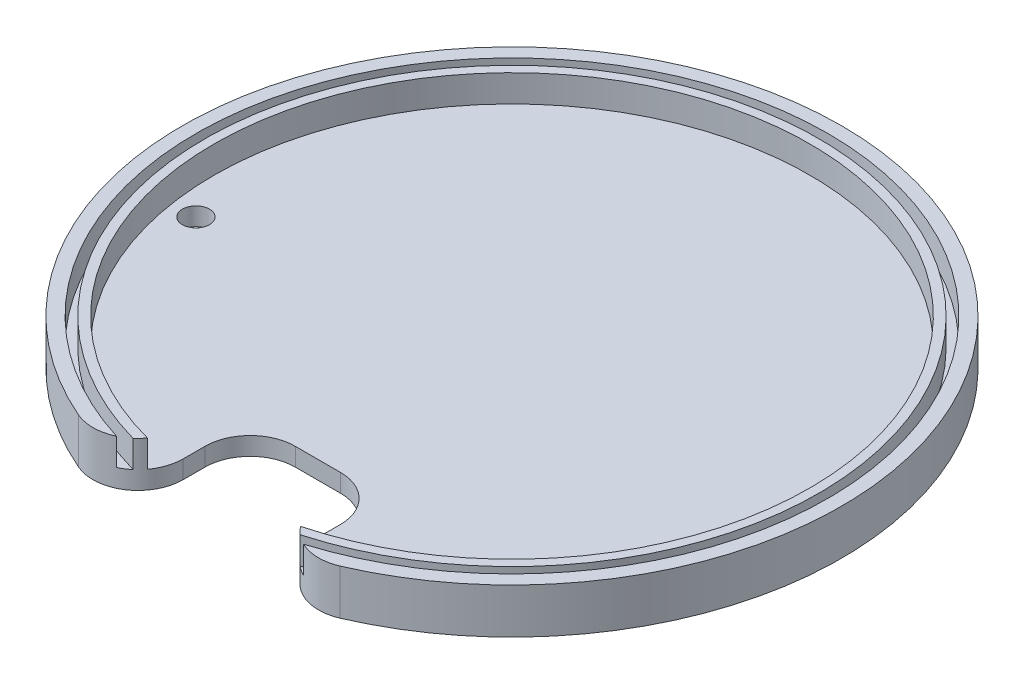
ISO-10303-21;
HEADER;
FILE_DESCRIPTION(('STEP AP214'),'2;1');
FILE_NAME('part.step','',(''),(''),'','','');
FILE_SCHEMA(('AUTOMOTIVE_DESIGN { 1 0 10303 214 1 1 1 1 }'));
ENDSEC;
DATA;
#1=APPLICATION_CONTEXT('core data for automotive mechanical design processes');
#2=APPLICATION_PROTOCOL_DEFINITION('international standard','automotive_design',2000,#1);
#3=PRODUCT_CONTEXT('',#1,'mechanical');
#4=PRODUCT('Part','Part','',(#3));
#5=PRODUCT_RELATED_PRODUCT_CATEGORY('part','',(#4));
#6=PRODUCT_DEFINITION_FORMATION('','',#4);
#7=PRODUCT_DEFINITION_CONTEXT('part definition',#1,'design');
#8=PRODUCT_DEFINITION('design','',#6,#7);
#9=PRODUCT_DEFINITION_SHAPE('','',#8);
#10=(LENGTH_UNIT() NAMED_UNIT(*) SI_UNIT(.MILLI.,.METRE.));
#11=(NAMED_UNIT(*) PLANE_ANGLE_UNIT() SI_UNIT($,.RADIAN.));
#12=(NAMED_UNIT(*) SI_UNIT($,.STERADIAN.) SOLID_ANGLE_UNIT());
#13=UNCERTAINTY_MEASURE_WITH_UNIT(LENGTH_MEASURE(1.E-05),#10,'distance_accuracy_value','');
#14=(GEOMETRIC_REPRESENTATION_CONTEXT(3) GLOBAL_UNCERTAINTY_ASSIGNED_CONTEXT((#13)) GLOBAL_UNIT_ASSIGNED_CONTEXT((#10,
#11,#12)) REPRESENTATION_CONTEXT('',''));
#15=CARTESIAN_POINT('',(0.,0.,0.));
#16=DIRECTION('',(0.,0.,1.));
#17=DIRECTION('',(1.,0.,0.));
#18=AXIS2_PLACEMENT_3D('',#15,#16,#17);
#19=CARTESIAN_POINT('',(0.,4.,0.));
#20=DIRECTION('',(0.,1.,0.));
#21=DIRECTION('',(0.,0.,1.));
#22=AXIS2_PLACEMENT_3D('',#19,#20,#21);
#23=PLANE('',#22);
#24=CARTESIAN_POINT('',(0.,4.,0.));
#25=DIRECTION('',(0.,1.,0.));
#26=DIRECTION('',(0.,0.,1.));
#27=AXIS2_PLACEMENT_3D('',#24,#25,#26);
#28=CIRCLE('',#27,68.);
#29=CARTESIAN_POINT('',(18.5073957889655,4.0000000000007,65.4329909228562));
#30=VERTEX_POINT('',#29);
#31=CARTESIAN_POINT('',(-18.5073957889656,4.0000000000007,65.4329909228562));
#32=VERTEX_POINT('',#31);
#33=EDGE_CURVE('E324',#30,#32,#28,.T.);
#34=ORIENTED_EDGE('',*,*,#33,.F.);
#35=CARTESIAN_POINT('',(25.,4.,57.8273291792038));
#36=DIRECTION('',(0.,1.,0.));
#37=DIRECTION('',(0.,0.,1.));
#38=AXIS2_PLACEMENT_3D('',#35,#36,#37);
#39=CIRCLE('',#38,10.);
#40=CARTESIAN_POINT('',(20.7174977817259,4.0000000000007,66.8639311263119));
#41=VERTEX_POINT('',#40);
#42=EDGE_CURVE('E219',#30,#41,#39,.T.);
#43=ORIENTED_EDGE('',*,*,#42,.T.);
#44=CARTESIAN_POINT('',(0.,4.,0.));
#45=DIRECTION('',(0.,1.,0.));
#46=DIRECTION('',(0.,0.,1.));
#47=AXIS2_PLACEMENT_3D('',#44,#45,#46);
#48=CIRCLE('',#47,70.);
#49=CARTESIAN_POINT('',(-20.717497781726,4.0000000000007,66.8639311263119));
#50=VERTEX_POINT('',#49);
#51=EDGE_CURVE('E185',#50,#41,#48,.F.);
#52=ORIENTED_EDGE('',*,*,#51,.F.);
#53=CARTESIAN_POINT('',(-25.,4.,57.8273291792039));
#54=DIRECTION('',(0.,1.,0.));
#55=DIRECTION('',(0.,0.,1.));
#56=AXIS2_PLACEMENT_3D('',#53,#54,#55);
#57=CIRCLE('',#56,10.);
#58=EDGE_CURVE('E216',#50,#32,#57,.T.);
#59=ORIENTED_EDGE('',*,*,#58,.T.);
#60=EDGE_LOOP('',(#34,#43,#52,#59));
#61=FACE_BOUND('',#60,.T.);
#62=ADVANCED_FACE('F52',(#61),#23,.T.);
#63=CARTESIAN_POINT('',(0.,10.,0.));
#64=DIRECTION('',(0.,-1.,0.));
#65=DIRECTION('',(0.,0.,-1.));
#66=AXIS2_PLACEMENT_3D('',#63,#64,#65);
#67=CYLINDRICAL_SURFACE('',#66,66.);
#68=CARTESIAN_POINT('',(0.,4.,0.));
#69=DIRECTION('',(0.,1.,0.));
#70=DIRECTION('',(0.,0.,1.));
#71=AXIS2_PLACEMENT_3D('',#68,#69,#70);
#72=CIRCLE('',#71,66.);
#73=CARTESIAN_POINT('',(-16.9662244483811,4.0000000000007,63.7820290361412));
#74=VERTEX_POINT('',#73);
#75=CARTESIAN_POINT('',(16.9662244483811,4.0000000000007,63.7820290361412));
#76=VERTEX_POINT('',#75);
#77=EDGE_CURVE('E192',#74,#76,#72,.F.);
#78=ORIENTED_EDGE('',*,*,#77,.T.);
#79=DIRECTION('',(0.,-1.,0.));
#80=VECTOR('',#79,1.);
#81=CARTESIAN_POINT('',(16.9662244483811,4.0000000000007,63.7820290361412));
#82=LINE('',#81,#80);
#83=CARTESIAN_POINT('',(16.9662244483811,10.0000000000007,63.7820290361412));
#84=VERTEX_POINT('',#83);
#85=EDGE_CURVE('E201',#76,#84,#82,.F.);
#86=ORIENTED_EDGE('',*,*,#85,.T.);
#87=CARTESIAN_POINT('',(0.,10.,0.));
#88=DIRECTION('',(0.,1.,0.));
#89=DIRECTION('',(0.,0.,1.));
#90=AXIS2_PLACEMENT_3D('',#87,#88,#89);
#91=CIRCLE('',#90,66.);
#92=CARTESIAN_POINT('',(-16.9662244483811,10.0000000000007,63.7820290361407));
#93=VERTEX_POINT('',#92);
#94=EDGE_CURVE('E325',#84,#93,#91,.T.);
#95=ORIENTED_EDGE('',*,*,#94,.T.);
#96=DIRECTION('',(0.,-1.,0.));
#97=VECTOR('',#96,1.);
#98=CARTESIAN_POINT('',(-16.9662244483811,10.0000000000007,63.7820290361407));
#99=LINE('',#98,#97);
#100=EDGE_CURVE('E198',#93,#74,#99,.T.);
#101=ORIENTED_EDGE('',*,*,#100,.T.);
#102=EDGE_LOOP('',(#78,#86,#95,#101));
#103=FACE_BOUND('',#102,.T.);
#104=ADVANCED_FACE('F342',(#103),#67,.F.);
#105=CARTESIAN_POINT('',(0.,10.,0.));
#106=DIRECTION('',(0.,-1.,0.));
#107=DIRECTION('',(0.,0.,-1.));
#108=AXIS2_PLACEMENT_3D('',#105,#106,#107);
#109=CYLINDRICAL_SURFACE('',#108,68.);
#110=CARTESIAN_POINT('',(0.,10.,0.));
#111=DIRECTION('',(0.,1.,0.));
#112=DIRECTION('',(0.,0.,1.));
#113=AXIS2_PLACEMENT_3D('',#110,#111,#112);
#114=CIRCLE('',#113,68.);
#115=CARTESIAN_POINT('',(18.5073957889655,10.0000000000007,65.4329909228562));
#116=VERTEX_POINT('',#115);
#117=CARTESIAN_POINT('',(-18.5073957889656,10.0000000000007,65.4329909228562));
#118=VERTEX_POINT('',#117);
#119=EDGE_CURVE('E329',#116,#118,#114,.T.);
#120=ORIENTED_EDGE('',*,*,#119,.F.);
#121=DIRECTION('',(0.,-1.,0.));
#122=VECTOR('',#121,1.);
#123=CARTESIAN_POINT('',(18.5073957889655,10.0000000000007,65.4329909228562));
#124=LINE('',#123,#122);
#125=EDGE_CURVE('E213',#116,#30,#124,.T.);
#126=ORIENTED_EDGE('',*,*,#125,.T.);
#127=ORIENTED_EDGE('',*,*,#33,.T.);
#128=DIRECTION('',(0.,-1.,0.));
#129=VECTOR('',#128,1.);
#130=CARTESIAN_POINT('',(-18.5073957889656,4.0000000000007,65.4329909228562));
#131=LINE('',#130,#129);
#132=EDGE_CURVE('E210',#32,#118,#131,.F.);
#133=ORIENTED_EDGE('',*,*,#132,.T.);
#134=EDGE_LOOP('',(#120,#126,#127,#133));
#135=FACE_BOUND('',#134,.T.);
#136=ADVANCED_FACE('F354',(#135),#109,.T.);
#137=CARTESIAN_POINT('',(0.,10.,0.));
#138=DIRECTION('',(0.,1.,0.));
#139=DIRECTION('',(0.,0.,1.));
#140=AXIS2_PLACEMENT_3D('',#137,#138,#139);
#141=PLANE('',#140);
#142=ORIENTED_EDGE('',*,*,#94,.F.);
#143=CARTESIAN_POINT('',(25.,9.99999999999998,57.8273291792038));
#144=DIRECTION('',(0.,1.,0.));
#145=DIRECTION('',(0.,0.,1.));
#146=AXIS2_PLACEMENT_3D('',#143,#144,#145);
#147=CIRCLE('',#146,10.);
#148=EDGE_CURVE('E207',#84,#116,#147,.T.);
#149=ORIENTED_EDGE('',*,*,#148,.T.);
#150=ORIENTED_EDGE('',*,*,#119,.T.);
#151=CARTESIAN_POINT('',(-25.,9.99999999999998,57.8273291792036));
#152=DIRECTION('',(0.,1.,0.));
#153=DIRECTION('',(0.,0.,1.));
#154=AXIS2_PLACEMENT_3D('',#151,#152,#153);
#155=CIRCLE('',#154,10.);
#156=EDGE_CURVE('E204',#118,#93,#155,.T.);
#157=ORIENTED_EDGE('',*,*,#156,.T.);
#158=EDGE_LOOP('',(#142,#149,#150,#157));
#159=FACE_BOUND('',#158,.T.);
#160=ADVANCED_FACE('F351',(#159),#141,.T.);
#161=CARTESIAN_POINT('',(-60.,4.,10.0000000000001));
#162=DIRECTION('',(0.,1.,0.));
#163=DIRECTION('',(0.,0.,1.));
#164=AXIS2_PLACEMENT_3D('',#161,#162,#163);
#165=CIRCLE('',#164,3.);
#166=CARTESIAN_POINT('',(-60.,4.,13.0000000000001));
#167=VERTEX_POINT('',#166);
#168=EDGE_CURVE('E368',#167,#167,#165,.F.);
#169=ORIENTED_EDGE('',*,*,#168,.T.);
#170=EDGE_LOOP('',(#169));
#171=FACE_BOUND('',#170,.T.);
#172=DIRECTION('',(1.,0.,0.));
#173=VECTOR('',#172,1.);
#174=CARTESIAN_POINT('',(-15.,4.,43.));
#175=LINE('',#174,#173);
#176=CARTESIAN_POINT('',(-5.,4.,43.));
#177=VERTEX_POINT('',#176);
#178=CARTESIAN_POINT('',(4.99999999999998,4.,43.0000000000002));
#179=VERTEX_POINT('',#178);
#180=EDGE_CURVE('E164',#177,#179,#175,.T.);
#181=ORIENTED_EDGE('',*,*,#180,.T.);
#182=CARTESIAN_POINT('',(4.99999999999995,4.,53.0000000000002));
#183=DIRECTION('',(0.,1.,0.));
#184=DIRECTION('',(0.,0.,1.));
#185=AXIS2_PLACEMENT_3D('',#182,#183,#184);
#186=CIRCLE('',#185,10.);
#187=CARTESIAN_POINT('',(15.,4.,53.));
#188=VERTEX_POINT('',#187);
#189=EDGE_CURVE('E259',#179,#188,#186,.F.);
#190=ORIENTED_EDGE('',*,*,#189,.T.);
#191=DIRECTION('',(0.,0.,1.));
#192=VECTOR('',#191,1.);
#193=CARTESIAN_POINT('',(14.9999999999999,4.00000000000067,73.));
#194=LINE('',#193,#192);
#195=CARTESIAN_POINT('',(15.,4.,57.8273291792038));
#196=VERTEX_POINT('',#195);
#197=EDGE_CURVE('E293',#188,#196,#194,.T.);
#198=ORIENTED_EDGE('',*,*,#197,.T.);
#199=CARTESIAN_POINT('',(25.,4.,57.8273291792038));
#200=DIRECTION('',(0.,1.,0.));
#201=DIRECTION('',(0.,0.,1.));
#202=AXIS2_PLACEMENT_3D('',#199,#200,#201);
#203=CIRCLE('',#202,10.);
#204=EDGE_CURVE('E182',#196,#76,#203,.T.);
#205=ORIENTED_EDGE('',*,*,#204,.T.);
#206=ORIENTED_EDGE('',*,*,#77,.F.);
#207=CARTESIAN_POINT('',(-25.,4.,57.8273291792039));
#208=DIRECTION('',(0.,1.,0.));
#209=DIRECTION('',(0.,0.,1.));
#210=AXIS2_PLACEMENT_3D('',#207,#208,#209);
#211=CIRCLE('',#210,10.);
#212=CARTESIAN_POINT('',(-15.0000000000001,4.,57.8273291792039));
#213=VERTEX_POINT('',#212);
#214=EDGE_CURVE('E184',#74,#213,#211,.T.);
#215=ORIENTED_EDGE('',*,*,#214,.T.);
#216=DIRECTION('',(0.,0.,-1.));
#217=VECTOR('',#216,1.);
#218=CARTESIAN_POINT('',(-15.0000000000001,4.0000000000007,73.));
#219=LINE('',#218,#217);
#220=CARTESIAN_POINT('',(-15.,4.,53.));
#221=VERTEX_POINT('',#220);
#222=EDGE_CURVE('E298',#213,#221,#219,.T.);
#223=ORIENTED_EDGE('',*,*,#222,.T.);
#224=CARTESIAN_POINT('',(-5.,4.,53.));
#225=DIRECTION('',(0.,1.,0.));
#226=DIRECTION('',(0.,0.,1.));
#227=AXIS2_PLACEMENT_3D('',#224,#225,#226);
#228=CIRCLE('',#227,10.);
#229=EDGE_CURVE('E12',#221,#177,#228,.F.);
#230=ORIENTED_EDGE('',*,*,#229,.T.);
#231=EDGE_LOOP('',(#181,#190,#198,#205,#206,#215,#223,#230));
#232=FACE_BOUND('',#231,.T.);
#233=ADVANCED_FACE('F292',(#171,#232),#23,.T.);
#234=CARTESIAN_POINT('',(0.,10.,0.));
#235=DIRECTION('',(0.,-1.,0.));
#236=DIRECTION('',(0.,0.,-1.));
#237=AXIS2_PLACEMENT_3D('',#234,#235,#236);
#238=CYLINDRICAL_SURFACE('',#237,70.);
#239=ORIENTED_EDGE('',*,*,#51,.T.);
#240=DIRECTION('',(0.,-1.,0.));
#241=VECTOR('',#240,1.);
#242=CARTESIAN_POINT('',(20.7174977817259,4.0000000000007,66.8639311263119));
#243=LINE('',#242,#241);
#244=CARTESIAN_POINT('',(20.7174977817259,10.0000000000007,66.8639311263119));
#245=VERTEX_POINT('',#244);
#246=EDGE_CURVE('E225',#41,#245,#243,.F.);
#247=ORIENTED_EDGE('',*,*,#246,.T.);
#248=CARTESIAN_POINT('',(0.,10.,0.));
#249=DIRECTION('',(0.,1.,0.));
#250=DIRECTION('',(0.,0.,1.));
#251=AXIS2_PLACEMENT_3D('',#248,#249,#250);
#252=CIRCLE('',#251,70.);
#253=CARTESIAN_POINT('',(-20.717497781726,10.0000000000007,66.8639311263115));
#254=VERTEX_POINT('',#253);
#255=EDGE_CURVE('E316',#245,#254,#252,.T.);
#256=ORIENTED_EDGE('',*,*,#255,.T.);
#257=DIRECTION('',(0.,-1.,0.));
#258=VECTOR('',#257,1.);
#259=CARTESIAN_POINT('',(-20.717497781726,10.0000000000007,66.8639311263115));
#260=LINE('',#259,#258);
#261=EDGE_CURVE('E222',#254,#50,#260,.T.);
#262=ORIENTED_EDGE('',*,*,#261,.T.);
#263=EDGE_LOOP('',(#239,#247,#256,#262));
#264=FACE_BOUND('',#263,.T.);
#265=ADVANCED_FACE('F389',(#264),#238,.F.);
#266=CARTESIAN_POINT('',(0.,10.,0.));
#267=DIRECTION('',(0.,1.,0.));
#268=DIRECTION('',(0.,0.,1.));
#269=AXIS2_PLACEMENT_3D('',#266,#267,#268);
#270=PLANE('',#269);
#271=ORIENTED_EDGE('',*,*,#255,.F.);
#272=CARTESIAN_POINT('',(25.,9.99999999999998,57.8273291792038));
#273=DIRECTION('',(0.,1.,0.));
#274=DIRECTION('',(0.,0.,1.));
#275=AXIS2_PLACEMENT_3D('',#272,#273,#274);
#276=CIRCLE('',#275,10.);
#277=CARTESIAN_POINT('',(28.9682539682539,10.0000000000007,67.00627031876));
#278=VERTEX_POINT('',#277);
#279=EDGE_CURVE('E231',#245,#278,#276,.T.);
#280=ORIENTED_EDGE('',*,*,#279,.T.);
#281=CARTESIAN_POINT('',(0.,10.,0.));
#282=DIRECTION('',(0.,1.,0.));
#283=DIRECTION('',(0.,0.,1.));
#284=AXIS2_PLACEMENT_3D('',#281,#282,#283);
#285=CIRCLE('',#284,73.);
#286=CARTESIAN_POINT('',(-28.968253968254,10.0000000000007,67.00627031876));
#287=VERTEX_POINT('',#286);
#288=EDGE_CURVE('E320',#278,#287,#285,.T.);
#289=ORIENTED_EDGE('',*,*,#288,.T.);
#290=CARTESIAN_POINT('',(-25.,9.99999999999998,57.8273291792036));
#291=DIRECTION('',(0.,1.,0.));
#292=DIRECTION('',(0.,0.,1.));
#293=AXIS2_PLACEMENT_3D('',#290,#291,#292);
#294=CIRCLE('',#293,10.);
#295=EDGE_CURVE('E228',#287,#254,#294,.T.);
#296=ORIENTED_EDGE('',*,*,#295,.T.);
#297=EDGE_LOOP('',(#271,#280,#289,#296));
#298=FACE_BOUND('',#297,.T.);
#299=ADVANCED_FACE('F381',(#298),#270,.T.);
#300=CARTESIAN_POINT('',(0.,0.,0.));
#301=DIRECTION('',(0.,1.,0.));
#302=DIRECTION('',(0.,0.,1.));
#303=AXIS2_PLACEMENT_3D('',#300,#301,#302);
#304=PLANE('',#303);
#305=CARTESIAN_POINT('',(-60.,0.,10.0000000000001));
#306=DIRECTION('',(0.,-1.,0.));
#307=DIRECTION('',(0.,0.,-1.));
#308=AXIS2_PLACEMENT_3D('',#305,#306,#307);
#309=CIRCLE('',#308,3.);
#310=CARTESIAN_POINT('',(-60.,0.,7.00000000000011));
#311=VERTEX_POINT('',#310);
#312=EDGE_CURVE('E299',#311,#311,#309,.T.);
#313=ORIENTED_EDGE('',*,*,#312,.F.);
#314=EDGE_LOOP('',(#313));
#315=FACE_BOUND('',#314,.T.);
#316=CARTESIAN_POINT('',(0.,0.,0.));
#317=DIRECTION('',(0.,1.,0.));
#318=DIRECTION('',(0.,0.,1.));
#319=AXIS2_PLACEMENT_3D('',#316,#317,#318);
#320=CIRCLE('',#319,73.);
#321=CARTESIAN_POINT('',(28.9682539682539,6.93889390390723E-13,67.00627031876));
#322=VERTEX_POINT('',#321);
#323=CARTESIAN_POINT('',(-28.968253968254,6.93889390390723E-13,67.00627031876));
#324=VERTEX_POINT('',#323);
#325=EDGE_CURVE('E172',#322,#324,#320,.T.);
#326=ORIENTED_EDGE('',*,*,#325,.F.);
#327=CARTESIAN_POINT('',(25.,0.,57.8273291792038));
#328=DIRECTION('',(0.,1.,0.));
#329=DIRECTION('',(0.,0.,1.));
#330=AXIS2_PLACEMENT_3D('',#327,#328,#329);
#331=CIRCLE('',#330,10.);
#332=CARTESIAN_POINT('',(15.,0.,57.8273291792038));
#333=VERTEX_POINT('',#332);
#334=EDGE_CURVE('E169',#322,#333,#331,.F.);
#335=ORIENTED_EDGE('',*,*,#334,.T.);
#336=DIRECTION('',(0.,0.,1.));
#337=VECTOR('',#336,1.);
#338=CARTESIAN_POINT('',(14.9999999999999,6.93889390390723E-13,73.));
#339=LINE('',#338,#337);
#340=CARTESIAN_POINT('',(15.,0.,53.));
#341=VERTEX_POINT('',#340);
#342=EDGE_CURVE('E155',#341,#333,#339,.T.);
#343=ORIENTED_EDGE('',*,*,#342,.F.);
#344=CARTESIAN_POINT('',(4.99999999999996,0.,53.));
#345=DIRECTION('',(0.,1.,0.));
#346=DIRECTION('',(0.,0.,1.));
#347=AXIS2_PLACEMENT_3D('',#344,#345,#346);
#348=CIRCLE('',#347,10.);
#349=CARTESIAN_POINT('',(4.99999999999998,0.,43.));
#350=VERTEX_POINT('',#349);
#351=EDGE_CURVE('E256',#341,#350,#348,.T.);
#352=ORIENTED_EDGE('',*,*,#351,.T.);
#353=DIRECTION('',(1.,0.,0.));
#354=VECTOR('',#353,1.);
#355=CARTESIAN_POINT('',(-15.,0.,43.));
#356=LINE('',#355,#354);
#357=CARTESIAN_POINT('',(-5.,0.,43.0000000000002));
#358=VERTEX_POINT('',#357);
#359=EDGE_CURVE('E165',#358,#350,#356,.T.);
#360=ORIENTED_EDGE('',*,*,#359,.F.);
#361=CARTESIAN_POINT('',(-5.,0.,53.0000000000002));
#362=DIRECTION('',(0.,1.,0.));
#363=DIRECTION('',(0.,0.,1.));
#364=AXIS2_PLACEMENT_3D('',#361,#362,#363);
#365=CIRCLE('',#364,10.);
#366=CARTESIAN_POINT('',(-15.,0.,53.));
#367=VERTEX_POINT('',#366);
#368=EDGE_CURVE('E61',#358,#367,#365,.T.);
#369=ORIENTED_EDGE('',*,*,#368,.T.);
#370=DIRECTION('',(0.,0.,-1.));
#371=VECTOR('',#370,1.);
#372=CARTESIAN_POINT('',(-15.0000000000001,6.93889390390723E-13,73.));
#373=LINE('',#372,#371);
#374=CARTESIAN_POINT('',(-15.0000000000001,0.,57.8273291792039));
#375=VERTEX_POINT('',#374);
#376=EDGE_CURVE('E307',#375,#367,#373,.T.);
#377=ORIENTED_EDGE('',*,*,#376,.F.);
#378=CARTESIAN_POINT('',(-25.,0.,57.8273291792039));
#379=DIRECTION('',(0.,1.,0.));
#380=DIRECTION('',(0.,0.,1.));
#381=AXIS2_PLACEMENT_3D('',#378,#379,#380);
#382=CIRCLE('',#381,10.);
#383=EDGE_CURVE('E177',#375,#324,#382,.F.);
#384=ORIENTED_EDGE('',*,*,#383,.T.);
#385=EDGE_LOOP('',(#326,#335,#343,#352,#360,#369,#377,#384));
#386=FACE_BOUND('',#385,.T.);
#387=ADVANCED_FACE('F170',(#315,#386),#304,.F.);
#388=CARTESIAN_POINT('',(0.,4.,0.));
#389=DIRECTION('',(0.,-1.,0.));
#390=DIRECTION('',(0.,0.,-1.));
#391=AXIS2_PLACEMENT_3D('',#388,#389,#390);
#392=CYLINDRICAL_SURFACE('',#391,73.);
#393=ORIENTED_EDGE('',*,*,#288,.F.);
#394=DIRECTION('',(0.,-1.,0.));
#395=VECTOR('',#394,1.);
#396=CARTESIAN_POINT('',(28.9682539682539,4.0000000000007,67.00627031876));
#397=LINE('',#396,#395);
#398=EDGE_CURVE('E237',#278,#322,#397,.T.);
#399=ORIENTED_EDGE('',*,*,#398,.T.);
#400=ORIENTED_EDGE('',*,*,#325,.T.);
#401=DIRECTION('',(0.,-1.,0.));
#402=VECTOR('',#401,1.);
#403=CARTESIAN_POINT('',(-28.968253968254,4.0000000000007,67.0062703187595));
#404=LINE('',#403,#402);
#405=EDGE_CURVE('E234',#324,#287,#404,.F.);
#406=ORIENTED_EDGE('',*,*,#405,.T.);
#407=EDGE_LOOP('',(#393,#399,#400,#406));
#408=FACE_BOUND('',#407,.T.);
#409=ADVANCED_FACE('F380',(#408),#392,.T.);
#410=CARTESIAN_POINT('',(-15.0000000000001,10.0010000000007,73.));
#411=DIRECTION('',(-1.,0.,0.));
#412=DIRECTION('',(0.,0.,1.));
#413=AXIS2_PLACEMENT_3D('',#410,#411,#412);
#414=PLANE('',#413);
#415=ORIENTED_EDGE('',*,*,#376,.T.);
#416=DIRECTION('',(0.,-1.,0.));
#417=VECTOR('',#416,1.);
#418=CARTESIAN_POINT('',(-15.,4.,53.));
#419=LINE('',#418,#417);
#420=EDGE_CURVE('E74',#367,#221,#419,.F.);
#421=ORIENTED_EDGE('',*,*,#420,.T.);
#422=ORIENTED_EDGE('',*,*,#222,.F.);
#423=DIRECTION('',(0.,-1.,0.));
#424=VECTOR('',#423,1.);
#425=CARTESIAN_POINT('',(-15.0000000000001,10.001,57.8273291792038));
#426=LINE('',#425,#424);
#427=EDGE_CURVE('E176',#213,#375,#426,.T.);
#428=ORIENTED_EDGE('',*,*,#427,.T.);
#429=EDGE_LOOP('',(#415,#421,#422,#428));
#430=FACE_BOUND('',#429,.T.);
#431=ADVANCED_FACE('F364',(#430),#414,.F.);
#432=CARTESIAN_POINT('',(14.9999999999999,10.0010000000007,73.));
#433=DIRECTION('',(1.,0.,0.));
#434=DIRECTION('',(0.,0.,-1.));
#435=AXIS2_PLACEMENT_3D('',#432,#433,#434);
#436=PLANE('',#435);
#437=ORIENTED_EDGE('',*,*,#197,.F.);
#438=DIRECTION('',(0.,-1.,0.));
#439=VECTOR('',#438,1.);
#440=CARTESIAN_POINT('',(15.,0.,53.));
#441=LINE('',#440,#439);
#442=EDGE_CURVE('E162',#188,#341,#441,.T.);
#443=ORIENTED_EDGE('',*,*,#442,.T.);
#444=ORIENTED_EDGE('',*,*,#342,.T.);
#445=DIRECTION('',(0.,-1.,0.));
#446=VECTOR('',#445,1.);
#447=CARTESIAN_POINT('',(14.9999999999999,10.001,57.8273291792041));
#448=LINE('',#447,#446);
#449=EDGE_CURVE('E160',#333,#196,#448,.F.);
#450=ORIENTED_EDGE('',*,*,#449,.T.);
#451=EDGE_LOOP('',(#437,#443,#444,#450));
#452=FACE_BOUND('',#451,.T.);
#453=ADVANCED_FACE('F158',(#452),#436,.F.);
#454=CARTESIAN_POINT('',(-15.,10.001,43.));
#455=DIRECTION('',(0.,0.,-1.));
#456=DIRECTION('',(-1.,0.,0.));
#457=AXIS2_PLACEMENT_3D('',#454,#455,#456);
#458=PLANE('',#457);
#459=ORIENTED_EDGE('',*,*,#359,.T.);
#460=DIRECTION('',(0.,-1.,0.));
#461=VECTOR('',#460,1.);
#462=CARTESIAN_POINT('',(4.99999999999998,4.,43.0000000000002));
#463=LINE('',#462,#461);
#464=EDGE_CURVE('E251',#350,#179,#463,.F.);
#465=ORIENTED_EDGE('',*,*,#464,.T.);
#466=ORIENTED_EDGE('',*,*,#180,.F.);
#467=DIRECTION('',(0.,-1.,0.));
#468=VECTOR('',#467,1.);
#469=CARTESIAN_POINT('',(-5.,0.,43.0000000000002));
#470=LINE('',#469,#468);
#471=EDGE_CURVE('E247',#177,#358,#470,.T.);
#472=ORIENTED_EDGE('',*,*,#471,.T.);
#473=EDGE_LOOP('',(#459,#465,#466,#472));
#474=FACE_BOUND('',#473,.T.);
#475=ADVANCED_FACE('F304',(#474),#458,.F.);
#476=CARTESIAN_POINT('',(25.,4.,57.8273291792038));
#477=DIRECTION('',(0.,-1.,0.));
#478=DIRECTION('',(0.,0.,-1.));
#479=AXIS2_PLACEMENT_3D('',#476,#477,#478);
#480=CYLINDRICAL_SURFACE('',#479,10.);
#481=ORIENTED_EDGE('',*,*,#334,.F.);
#482=ORIENTED_EDGE('',*,*,#398,.F.);
#483=ORIENTED_EDGE('',*,*,#279,.F.);
#484=ORIENTED_EDGE('',*,*,#246,.F.);
#485=ORIENTED_EDGE('',*,*,#42,.F.);
#486=ORIENTED_EDGE('',*,*,#125,.F.);
#487=ORIENTED_EDGE('',*,*,#148,.F.);
#488=ORIENTED_EDGE('',*,*,#85,.F.);
#489=ORIENTED_EDGE('',*,*,#204,.F.);
#490=ORIENTED_EDGE('',*,*,#449,.F.);
#491=EDGE_LOOP('',(#481,#482,#483,#484,#485,#486,#487,#488,#489,#490));
#492=FACE_BOUND('',#491,.T.);
#493=ADVANCED_FACE('F180',(#492),#480,.T.);
#494=CARTESIAN_POINT('',(-25.,4.,57.8273291792039));
#495=DIRECTION('',(0.,-1.,0.));
#496=DIRECTION('',(0.,0.,-1.));
#497=AXIS2_PLACEMENT_3D('',#494,#495,#496);
#498=CYLINDRICAL_SURFACE('',#497,10.);
#499=ORIENTED_EDGE('',*,*,#295,.F.);
#500=ORIENTED_EDGE('',*,*,#405,.F.);
#501=ORIENTED_EDGE('',*,*,#383,.F.);
#502=ORIENTED_EDGE('',*,*,#427,.F.);
#503=ORIENTED_EDGE('',*,*,#214,.F.);
#504=ORIENTED_EDGE('',*,*,#100,.F.);
#505=ORIENTED_EDGE('',*,*,#156,.F.);
#506=ORIENTED_EDGE('',*,*,#132,.F.);
#507=ORIENTED_EDGE('',*,*,#58,.F.);
#508=ORIENTED_EDGE('',*,*,#261,.F.);
#509=EDGE_LOOP('',(#499,#500,#501,#502,#503,#504,#505,#506,#507,#508));
#510=FACE_BOUND('',#509,.T.);
#511=ADVANCED_FACE('F360',(#510),#498,.T.);
#512=CARTESIAN_POINT('',(4.99999999999995,10.001,53.));
#513=DIRECTION('',(0.,1.,0.));
#514=DIRECTION('',(0.,0.,1.));
#515=AXIS2_PLACEMENT_3D('',#512,#513,#514);
#516=CYLINDRICAL_SURFACE('',#515,10.);
#517=ORIENTED_EDGE('',*,*,#189,.F.);
#518=ORIENTED_EDGE('',*,*,#464,.F.);
#519=ORIENTED_EDGE('',*,*,#351,.F.);
#520=ORIENTED_EDGE('',*,*,#442,.F.);
#521=EDGE_LOOP('',(#517,#518,#519,#520));
#522=FACE_BOUND('',#521,.T.);
#523=ADVANCED_FACE('F301',(#522),#516,.F.);
#524=CARTESIAN_POINT('',(-5.00000000000008,10.001,53.));
#525=DIRECTION('',(0.,1.,0.));
#526=DIRECTION('',(0.,0.,1.));
#527=AXIS2_PLACEMENT_3D('',#524,#525,#526);
#528=CYLINDRICAL_SURFACE('',#527,10.);
#529=ORIENTED_EDGE('',*,*,#229,.F.);
#530=ORIENTED_EDGE('',*,*,#420,.F.);
#531=ORIENTED_EDGE('',*,*,#368,.F.);
#532=ORIENTED_EDGE('',*,*,#471,.F.);
#533=EDGE_LOOP('',(#529,#530,#531,#532));
#534=FACE_BOUND('',#533,.T.);
#535=ADVANCED_FACE('F54',(#534),#528,.F.);
#536=CARTESIAN_POINT('',(-60.,10.001,10.0000000000002));
#537=DIRECTION('',(0.,-1.,0.));
#538=DIRECTION('',(0.,0.,-1.));
#539=AXIS2_PLACEMENT_3D('',#536,#537,#538);
#540=CYLINDRICAL_SURFACE('',#539,3.);
#541=ORIENTED_EDGE('',*,*,#168,.F.);
#542=EDGE_LOOP('',(#541));
#543=FACE_BOUND('',#542,.T.);
#544=ORIENTED_EDGE('',*,*,#312,.T.);
#545=EDGE_LOOP('',(#544));
#546=FACE_BOUND('',#545,.T.);
#547=ADVANCED_FACE('F377',(#543,#546),#540,.F.);
#548=CLOSED_SHELL('',(#62,#104,#136,#160,#233,#265,#299,#387,#409,#431,#453,#475,#493,#511,#523,
#535,#547));
#549=MANIFOLD_SOLID_BREP('B2',#548);
#550=ADVANCED_BREP_SHAPE_REPRESENTATION('',(#18,#549),#14);
#551=SHAPE_DEFINITION_REPRESENTATION(#9,#550);
ENDSEC;
END-ISO-10303-21;
